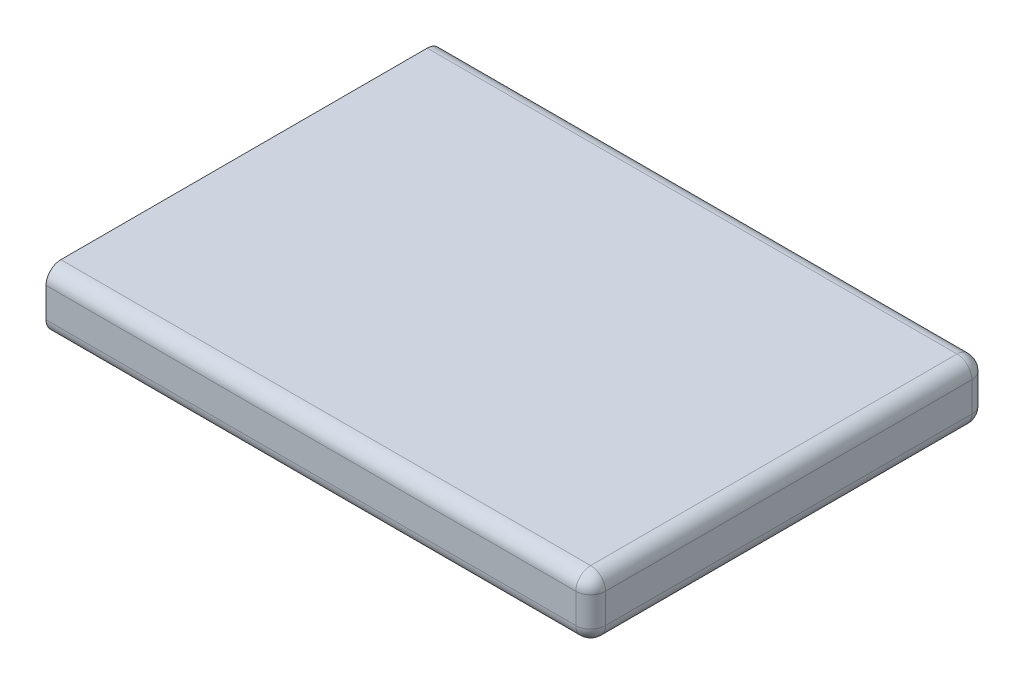
ISO-10303-21;
HEADER;
FILE_DESCRIPTION(('STEP AP214'),'2;1');
FILE_NAME('part.step','',(''),(''),'','','');
FILE_SCHEMA(('AUTOMOTIVE_DESIGN { 1 0 10303 214 1 1 1 1 }'));
ENDSEC;
DATA;
#1=APPLICATION_CONTEXT('core data for automotive mechanical design processes');
#2=APPLICATION_PROTOCOL_DEFINITION('international standard','automotive_design',2000,#1);
#3=PRODUCT_CONTEXT('',#1,'mechanical');
#4=PRODUCT('Part','Part','',(#3));
#5=PRODUCT_RELATED_PRODUCT_CATEGORY('part','',(#4));
#6=PRODUCT_DEFINITION_FORMATION('','',#4);
#7=PRODUCT_DEFINITION_CONTEXT('part definition',#1,'design');
#8=PRODUCT_DEFINITION('design','',#6,#7);
#9=PRODUCT_DEFINITION_SHAPE('','',#8);
#10=(LENGTH_UNIT() NAMED_UNIT(*) SI_UNIT(.MILLI.,.METRE.));
#11=(NAMED_UNIT(*) PLANE_ANGLE_UNIT() SI_UNIT($,.RADIAN.));
#12=(NAMED_UNIT(*) SI_UNIT($,.STERADIAN.) SOLID_ANGLE_UNIT());
#13=UNCERTAINTY_MEASURE_WITH_UNIT(LENGTH_MEASURE(1.E-05),#10,'distance_accuracy_value','');
#14=(GEOMETRIC_REPRESENTATION_CONTEXT(3) GLOBAL_UNCERTAINTY_ASSIGNED_CONTEXT((#13)) GLOBAL_UNIT_ASSIGNED_CONTEXT((#10,
#11,#12)) REPRESENTATION_CONTEXT('',''));
#15=CARTESIAN_POINT('',(0.,0.,0.));
#16=DIRECTION('',(0.,0.,1.));
#17=DIRECTION('',(1.,0.,0.));
#18=AXIS2_PLACEMENT_3D('',#15,#16,#17);
#19=CARTESIAN_POINT('',(33.894807191743,6.,-7.628255018401));
#20=DIRECTION('',(0.,-1.,0.));
#21=DIRECTION('',(0.,0.,-1.));
#22=AXIS2_PLACEMENT_3D('',#19,#20,#21);
#23=CYLINDRICAL_SURFACE('',#22,1.5);
#24=CARTESIAN_POINT('',(33.894807191743,4.5,-7.628255018401));
#25=DIRECTION('',(0.,-1.,0.));
#26=DIRECTION('',(0.,0.,1.));
#27=AXIS2_PLACEMENT_3D('',#24,#25,#26);
#28=CIRCLE('',#27,1.5);
#29=CARTESIAN_POINT('',(33.894807191743,4.5,-9.128255018401));
#30=VERTEX_POINT('',#29);
#31=CARTESIAN_POINT('',(35.394807191743,4.5,-7.628255018401));
#32=VERTEX_POINT('',#31);
#33=EDGE_CURVE('E26',#30,#32,#28,.T.);
#34=ORIENTED_EDGE('',*,*,#33,.T.);
#35=DIRECTION('',(0.,1.,0.));
#36=VECTOR('',#35,1.);
#37=CARTESIAN_POINT('',(35.394807191743,6.,-7.628255018401));
#38=LINE('',#37,#36);
#39=CARTESIAN_POINT('',(35.394807191743,1.5,-7.628255018401));
#40=VERTEX_POINT('',#39);
#41=EDGE_CURVE('E147',#40,#32,#38,.T.);
#42=ORIENTED_EDGE('',*,*,#41,.F.);
#43=CARTESIAN_POINT('',(33.894807191743,1.5,-7.628255018401));
#44=DIRECTION('',(0.,1.,0.));
#45=DIRECTION('',(0.,0.,-1.));
#46=AXIS2_PLACEMENT_3D('',#43,#44,#45);
#47=CIRCLE('',#46,1.5);
#48=CARTESIAN_POINT('',(33.894807191743,1.5,-9.128255018401));
#49=VERTEX_POINT('',#48);
#50=EDGE_CURVE('E11',#40,#49,#47,.T.);
#51=ORIENTED_EDGE('',*,*,#50,.T.);
#52=DIRECTION('',(0.,-1.,0.));
#53=VECTOR('',#52,1.);
#54=CARTESIAN_POINT('',(33.894807191743,6.,-9.128255018401));
#55=LINE('',#54,#53);
#56=EDGE_CURVE('E194',#30,#49,#55,.T.);
#57=ORIENTED_EDGE('',*,*,#56,.F.);
#58=EDGE_LOOP('',(#34,#42,#51,#57));
#59=FACE_BOUND('',#58,.T.);
#60=ADVANCED_FACE('F16',(#59),#23,.T.);
#61=CARTESIAN_POINT('',(33.894807191743,1.5,-7.628255018401));
#62=DIRECTION('',(0.,-1.,0.));
#63=DIRECTION('',(0.,0.,-1.));
#64=AXIS2_PLACEMENT_3D('',#61,#62,#63);
#65=SPHERICAL_SURFACE('',#64,1.5);
#66=CARTESIAN_POINT('',(33.894807191743,1.5,-7.628255018401));
#67=DIRECTION('',(0.,0.,-1.));
#68=DIRECTION('',(-1.,0.,0.));
#69=AXIS2_PLACEMENT_3D('',#66,#67,#68);
#70=CIRCLE('',#69,1.5);
#71=CARTESIAN_POINT('',(33.894807191743,0.,-7.628255018401));
#72=VERTEX_POINT('',#71);
#73=EDGE_CURVE('E198',#40,#72,#70,.T.);
#74=ORIENTED_EDGE('',*,*,#73,.T.);
#75=CARTESIAN_POINT('',(33.894807191743,1.5,-7.628255018401));
#76=DIRECTION('',(1.,0.,0.));
#77=DIRECTION('',(0.,0.,-1.));
#78=AXIS2_PLACEMENT_3D('',#75,#76,#77);
#79=CIRCLE('',#78,1.5);
#80=EDGE_CURVE('E201',#72,#49,#79,.T.);
#81=ORIENTED_EDGE('',*,*,#80,.T.);
#82=ORIENTED_EDGE('',*,*,#50,.F.);
#83=EDGE_LOOP('',(#74,#81,#82));
#84=FACE_BOUND('',#83,.T.);
#85=ADVANCED_FACE('F296',(#84),#65,.T.);
#86=CARTESIAN_POINT('',(33.894807191743,4.5,-7.628255018401));
#87=DIRECTION('',(0.,1.,0.));
#88=DIRECTION('',(0.,0.,1.));
#89=AXIS2_PLACEMENT_3D('',#86,#87,#88);
#90=SPHERICAL_SURFACE('',#89,1.5);
#91=CARTESIAN_POINT('',(33.894807191743,4.5,-7.628255018401));
#92=DIRECTION('',(1.,0.,0.));
#93=DIRECTION('',(0.,0.,-1.));
#94=AXIS2_PLACEMENT_3D('',#91,#92,#93);
#95=CIRCLE('',#94,1.5);
#96=CARTESIAN_POINT('',(33.894807191743,6.,-7.628255018401));
#97=VERTEX_POINT('',#96);
#98=EDGE_CURVE('E173',#30,#97,#95,.T.);
#99=ORIENTED_EDGE('',*,*,#98,.T.);
#100=CARTESIAN_POINT('',(33.894807191743,4.5,-7.628255018401));
#101=DIRECTION('',(0.,0.,-1.));
#102=DIRECTION('',(-1.,0.,0.));
#103=AXIS2_PLACEMENT_3D('',#100,#101,#102);
#104=CIRCLE('',#103,1.5);
#105=EDGE_CURVE('E221',#97,#32,#104,.T.);
#106=ORIENTED_EDGE('',*,*,#105,.T.);
#107=ORIENTED_EDGE('',*,*,#33,.F.);
#108=EDGE_LOOP('',(#99,#106,#107));
#109=FACE_BOUND('',#108,.T.);
#110=ADVANCED_FACE('F303',(#109),#90,.T.);
#111=CARTESIAN_POINT('',(33.894807191743,1.5,30.871744981599));
#112=DIRECTION('',(0.,0.,1.));
#113=DIRECTION('',(1.,0.,0.));
#114=AXIS2_PLACEMENT_3D('',#111,#112,#113);
#115=CYLINDRICAL_SURFACE('',#114,1.5);
#116=CARTESIAN_POINT('',(33.894807191743,1.5,29.371744981599));
#117=DIRECTION('',(0.,0.,-1.));
#118=DIRECTION('',(1.,0.,0.));
#119=AXIS2_PLACEMENT_3D('',#116,#117,#118);
#120=CIRCLE('',#119,1.5);
#121=CARTESIAN_POINT('',(35.394807191743,1.5,29.371744981599));
#122=VERTEX_POINT('',#121);
#123=CARTESIAN_POINT('',(33.894807191743,0.,29.371744981599));
#124=VERTEX_POINT('',#123);
#125=EDGE_CURVE('E39',#122,#124,#120,.T.);
#126=ORIENTED_EDGE('',*,*,#125,.T.);
#127=DIRECTION('',(0.,0.,1.));
#128=VECTOR('',#127,1.);
#129=CARTESIAN_POINT('',(33.894807191743,0.,30.871744981599));
#130=LINE('',#129,#128);
#131=EDGE_CURVE('E182',#72,#124,#130,.T.);
#132=ORIENTED_EDGE('',*,*,#131,.F.);
#133=ORIENTED_EDGE('',*,*,#73,.F.);
#134=DIRECTION('',(0.,0.,-1.));
#135=VECTOR('',#134,1.);
#136=CARTESIAN_POINT('',(35.394807191743,1.5,-9.128255018401));
#137=LINE('',#136,#135);
#138=EDGE_CURVE('E190',#122,#40,#137,.T.);
#139=ORIENTED_EDGE('',*,*,#138,.F.);
#140=EDGE_LOOP('',(#126,#132,#133,#139));
#141=FACE_BOUND('',#140,.T.);
#142=ADVANCED_FACE('F307',(#141),#115,.T.);
#143=CARTESIAN_POINT('',(-19.60519280825,1.5,-7.628255018401));
#144=DIRECTION('',(1.,0.,0.));
#145=DIRECTION('',(0.,0.,-1.));
#146=AXIS2_PLACEMENT_3D('',#143,#144,#145);
#147=CYLINDRICAL_SURFACE('',#146,1.5);
#148=CARTESIAN_POINT('',(-19.60519280825,1.5,-7.628255018401));
#149=DIRECTION('',(-1.,0.,0.));
#150=DIRECTION('',(0.,0.,-1.));
#151=AXIS2_PLACEMENT_3D('',#148,#149,#150);
#152=CIRCLE('',#151,1.5);
#153=CARTESIAN_POINT('',(-19.60519280825,1.5,-9.128255018401));
#154=VERTEX_POINT('',#153);
#155=CARTESIAN_POINT('',(-19.60519280825,0.,-7.628255018401));
#156=VERTEX_POINT('',#155);
#157=EDGE_CURVE('E202',#154,#156,#152,.T.);
#158=ORIENTED_EDGE('',*,*,#157,.F.);
#159=DIRECTION('',(-1.,0.,0.));
#160=VECTOR('',#159,1.);
#161=CARTESIAN_POINT('',(-19.60519280825,1.5,-9.128255018401));
#162=LINE('',#161,#160);
#163=EDGE_CURVE('E233',#49,#154,#162,.T.);
#164=ORIENTED_EDGE('',*,*,#163,.F.);
#165=ORIENTED_EDGE('',*,*,#80,.F.);
#166=DIRECTION('',(1.,0.,0.));
#167=VECTOR('',#166,1.);
#168=CARTESIAN_POINT('',(35.394807191743,0.,-7.628255018401));
#169=LINE('',#168,#167);
#170=EDGE_CURVE('E181',#156,#72,#169,.T.);
#171=ORIENTED_EDGE('',*,*,#170,.F.);
#172=EDGE_LOOP('',(#158,#164,#165,#171));
#173=FACE_BOUND('',#172,.T.);
#174=ADVANCED_FACE('F18',(#173),#147,.T.);
#175=CARTESIAN_POINT('',(0.,4.5,-7.628255018401));
#176=DIRECTION('',(-1.,0.,0.));
#177=DIRECTION('',(0.,0.,1.));
#178=AXIS2_PLACEMENT_3D('',#175,#176,#177);
#179=CYLINDRICAL_SURFACE('',#178,1.5);
#180=CARTESIAN_POINT('',(-19.60519280825,4.5,-7.628255018401));
#181=DIRECTION('',(-1.,0.,0.));
#182=DIRECTION('',(0.,0.,-1.));
#183=AXIS2_PLACEMENT_3D('',#180,#181,#182);
#184=CIRCLE('',#183,1.5);
#185=CARTESIAN_POINT('',(-19.60519280825,6.,-7.628255018401));
#186=VERTEX_POINT('',#185);
#187=CARTESIAN_POINT('',(-19.60519280825,4.5,-9.128255018401));
#188=VERTEX_POINT('',#187);
#189=EDGE_CURVE('E238',#186,#188,#184,.T.);
#190=ORIENTED_EDGE('',*,*,#189,.F.);
#191=DIRECTION('',(-1.,0.,0.));
#192=VECTOR('',#191,1.);
#193=CARTESIAN_POINT('',(0.,6.,-7.628255018401));
#194=LINE('',#193,#192);
#195=EDGE_CURVE('E256',#97,#186,#194,.T.);
#196=ORIENTED_EDGE('',*,*,#195,.F.);
#197=ORIENTED_EDGE('',*,*,#98,.F.);
#198=DIRECTION('',(1.,0.,0.));
#199=VECTOR('',#198,1.);
#200=CARTESIAN_POINT('',(-19.60519280825,4.5,-9.128255018401));
#201=LINE('',#200,#199);
#202=EDGE_CURVE('E228',#188,#30,#201,.T.);
#203=ORIENTED_EDGE('',*,*,#202,.F.);
#204=EDGE_LOOP('',(#190,#196,#197,#203));
#205=FACE_BOUND('',#204,.T.);
#206=ADVANCED_FACE('F276',(#205),#179,.T.);
#207=CARTESIAN_POINT('',(33.894807191743,4.5,0.));
#208=DIRECTION('',(0.,0.,-1.));
#209=DIRECTION('',(-1.,0.,0.));
#210=AXIS2_PLACEMENT_3D('',#207,#208,#209);
#211=CYLINDRICAL_SURFACE('',#210,1.5);
#212=CARTESIAN_POINT('',(33.894807191743,4.5,29.371744981599));
#213=DIRECTION('',(0.,0.,-1.));
#214=DIRECTION('',(1.,0.,0.));
#215=AXIS2_PLACEMENT_3D('',#212,#213,#214);
#216=CIRCLE('',#215,1.5);
#217=CARTESIAN_POINT('',(33.894807191743,6.,29.371744981599));
#218=VERTEX_POINT('',#217);
#219=CARTESIAN_POINT('',(35.394807191743,4.5,29.371744981599));
#220=VERTEX_POINT('',#219);
#221=EDGE_CURVE('E177',#218,#220,#216,.T.);
#222=ORIENTED_EDGE('',*,*,#221,.T.);
#223=DIRECTION('',(0.,0.,1.));
#224=VECTOR('',#223,1.);
#225=CARTESIAN_POINT('',(35.394807191743,4.5,30.871744981599));
#226=LINE('',#225,#224);
#227=EDGE_CURVE('E210',#32,#220,#226,.T.);
#228=ORIENTED_EDGE('',*,*,#227,.F.);
#229=ORIENTED_EDGE('',*,*,#105,.F.);
#230=DIRECTION('',(0.,0.,-1.));
#231=VECTOR('',#230,1.);
#232=CARTESIAN_POINT('',(33.894807191743,6.,0.));
#233=LINE('',#232,#231);
#234=EDGE_CURVE('E232',#218,#97,#233,.T.);
#235=ORIENTED_EDGE('',*,*,#234,.F.);
#236=EDGE_LOOP('',(#222,#228,#229,#235));
#237=FACE_BOUND('',#236,.T.);
#238=ADVANCED_FACE('F309',(#237),#211,.T.);
#239=CARTESIAN_POINT('',(33.894807191743,1.5,29.371744981599));
#240=DIRECTION('',(0.,0.,1.));
#241=DIRECTION('',(0.,-1.,0.));
#242=AXIS2_PLACEMENT_3D('',#239,#240,#241);
#243=SPHERICAL_SURFACE('',#242,1.5);
#244=CARTESIAN_POINT('',(33.894807191743,1.5,29.371744981599));
#245=DIRECTION('',(0.,-1.,0.));
#246=DIRECTION('',(0.,0.,-1.));
#247=AXIS2_PLACEMENT_3D('',#244,#245,#246);
#248=CIRCLE('',#247,1.5);
#249=CARTESIAN_POINT('',(33.894807191743,1.5,30.871744981599));
#250=VERTEX_POINT('',#249);
#251=EDGE_CURVE('E175',#122,#250,#248,.T.);
#252=ORIENTED_EDGE('',*,*,#251,.T.);
#253=CARTESIAN_POINT('',(33.894807191743,1.5,29.371744981599));
#254=DIRECTION('',(1.,0.,0.));
#255=DIRECTION('',(0.,0.,-1.));
#256=AXIS2_PLACEMENT_3D('',#253,#254,#255);
#257=CIRCLE('',#256,1.5);
#258=EDGE_CURVE('E188',#250,#124,#257,.T.);
#259=ORIENTED_EDGE('',*,*,#258,.T.);
#260=ORIENTED_EDGE('',*,*,#125,.F.);
#261=EDGE_LOOP('',(#252,#259,#260));
#262=FACE_BOUND('',#261,.T.);
#263=ADVANCED_FACE('F311',(#262),#243,.T.);
#264=CARTESIAN_POINT('',(33.894807191743,4.5,29.371744981599));
#265=DIRECTION('',(0.,0.,1.));
#266=DIRECTION('',(1.,0.,0.));
#267=AXIS2_PLACEMENT_3D('',#264,#265,#266);
#268=SPHERICAL_SURFACE('',#267,1.5);
#269=CARTESIAN_POINT('',(33.894807191743,4.5,29.371744981599));
#270=DIRECTION('',(1.,0.,0.));
#271=DIRECTION('',(0.,0.,-1.));
#272=AXIS2_PLACEMENT_3D('',#269,#270,#271);
#273=CIRCLE('',#272,1.5);
#274=CARTESIAN_POINT('',(33.894807191743,4.5,30.871744981599));
#275=VERTEX_POINT('',#274);
#276=EDGE_CURVE('E186',#218,#275,#273,.T.);
#277=ORIENTED_EDGE('',*,*,#276,.T.);
#278=CARTESIAN_POINT('',(33.894807191743,4.5,29.371744981599));
#279=DIRECTION('',(0.,1.,0.));
#280=DIRECTION('',(0.,0.,1.));
#281=AXIS2_PLACEMENT_3D('',#278,#279,#280);
#282=CIRCLE('',#281,1.5);
#283=EDGE_CURVE('E98',#275,#220,#282,.T.);
#284=ORIENTED_EDGE('',*,*,#283,.T.);
#285=ORIENTED_EDGE('',*,*,#221,.F.);
#286=EDGE_LOOP('',(#277,#284,#285));
#287=FACE_BOUND('',#286,.T.);
#288=ADVANCED_FACE('F317',(#287),#268,.T.);
#289=CARTESIAN_POINT('',(33.894807191743,6.,29.371744981599));
#290=DIRECTION('',(0.,-1.,0.));
#291=DIRECTION('',(0.,0.,-1.));
#292=AXIS2_PLACEMENT_3D('',#289,#290,#291);
#293=CYLINDRICAL_SURFACE('',#292,1.5);
#294=ORIENTED_EDGE('',*,*,#283,.F.);
#295=DIRECTION('',(0.,1.,0.));
#296=VECTOR('',#295,1.);
#297=CARTESIAN_POINT('',(33.894807191743,6.,30.871744981599));
#298=LINE('',#297,#296);
#299=EDGE_CURVE('E143',#250,#275,#298,.T.);
#300=ORIENTED_EDGE('',*,*,#299,.F.);
#301=ORIENTED_EDGE('',*,*,#251,.F.);
#302=DIRECTION('',(0.,-1.,0.));
#303=VECTOR('',#302,1.);
#304=CARTESIAN_POINT('',(35.394807191743,6.,29.371744981599));
#305=LINE('',#304,#303);
#306=EDGE_CURVE('E195',#220,#122,#305,.T.);
#307=ORIENTED_EDGE('',*,*,#306,.F.);
#308=EDGE_LOOP('',(#294,#300,#301,#307));
#309=FACE_BOUND('',#308,.T.);
#310=ADVANCED_FACE('F323',(#309),#293,.T.);
#311=CARTESIAN_POINT('',(-19.60519280825,1.5,29.371744981599));
#312=DIRECTION('',(-1.,0.,0.));
#313=DIRECTION('',(0.,0.,1.));
#314=AXIS2_PLACEMENT_3D('',#311,#312,#313);
#315=CYLINDRICAL_SURFACE('',#314,1.5);
#316=CARTESIAN_POINT('',(-19.60519280825,1.5,29.371744981599));
#317=DIRECTION('',(-1.,0.,0.));
#318=DIRECTION('',(0.,0.,-1.));
#319=AXIS2_PLACEMENT_3D('',#316,#317,#318);
#320=CIRCLE('',#319,1.5);
#321=CARTESIAN_POINT('',(-19.60519280825,0.,29.371744981599));
#322=VERTEX_POINT('',#321);
#323=CARTESIAN_POINT('',(-19.60519280825,1.5,30.871744981599));
#324=VERTEX_POINT('',#323);
#325=EDGE_CURVE('E162',#322,#324,#320,.T.);
#326=ORIENTED_EDGE('',*,*,#325,.F.);
#327=DIRECTION('',(-1.,0.,0.));
#328=VECTOR('',#327,1.);
#329=CARTESIAN_POINT('',(-19.60519280825,0.,29.371744981599));
#330=LINE('',#329,#328);
#331=EDGE_CURVE('E178',#124,#322,#330,.T.);
#332=ORIENTED_EDGE('',*,*,#331,.F.);
#333=ORIENTED_EDGE('',*,*,#258,.F.);
#334=DIRECTION('',(1.,0.,0.));
#335=VECTOR('',#334,1.);
#336=CARTESIAN_POINT('',(35.394807191743,1.5,30.871744981599));
#337=LINE('',#336,#335);
#338=EDGE_CURVE('E130',#324,#250,#337,.T.);
#339=ORIENTED_EDGE('',*,*,#338,.F.);
#340=EDGE_LOOP('',(#326,#332,#333,#339));
#341=FACE_BOUND('',#340,.T.);
#342=ADVANCED_FACE('F321',(#341),#315,.T.);
#343=CARTESIAN_POINT('',(0.,4.5,29.371744981599));
#344=DIRECTION('',(1.,0.,0.));
#345=DIRECTION('',(0.,0.,-1.));
#346=AXIS2_PLACEMENT_3D('',#343,#344,#345);
#347=CYLINDRICAL_SURFACE('',#346,1.5);
#348=CARTESIAN_POINT('',(-19.60519280825,4.5,29.371744981599));
#349=DIRECTION('',(-1.,0.,0.));
#350=DIRECTION('',(0.,0.,-1.));
#351=AXIS2_PLACEMENT_3D('',#348,#349,#350);
#352=CIRCLE('',#351,1.5);
#353=CARTESIAN_POINT('',(-19.60519280825,4.5,30.871744981599));
#354=VERTEX_POINT('',#353);
#355=CARTESIAN_POINT('',(-19.60519280825,6.,29.371744981599));
#356=VERTEX_POINT('',#355);
#357=EDGE_CURVE('E150',#354,#356,#352,.T.);
#358=ORIENTED_EDGE('',*,*,#357,.F.);
#359=DIRECTION('',(-1.,0.,0.));
#360=VECTOR('',#359,1.);
#361=CARTESIAN_POINT('',(-19.60519280825,4.5,30.871744981599));
#362=LINE('',#361,#360);
#363=EDGE_CURVE('E137',#275,#354,#362,.T.);
#364=ORIENTED_EDGE('',*,*,#363,.F.);
#365=ORIENTED_EDGE('',*,*,#276,.F.);
#366=DIRECTION('',(1.,0.,0.));
#367=VECTOR('',#366,1.);
#368=CARTESIAN_POINT('',(0.,6.,29.371744981599));
#369=LINE('',#368,#367);
#370=EDGE_CURVE('E153',#356,#218,#369,.T.);
#371=ORIENTED_EDGE('',*,*,#370,.F.);
#372=EDGE_LOOP('',(#358,#364,#365,#371));
#373=FACE_BOUND('',#372,.T.);
#374=ADVANCED_FACE('F151',(#373),#347,.T.);
#375=CARTESIAN_POINT('',(0.,0.,0.));
#376=DIRECTION('',(0.,-1.,0.));
#377=DIRECTION('',(0.,0.,-1.));
#378=AXIS2_PLACEMENT_3D('',#375,#376,#377);
#379=PLANE('',#378);
#380=ORIENTED_EDGE('',*,*,#131,.T.);
#381=ORIENTED_EDGE('',*,*,#331,.T.);
#382=DIRECTION('',(0.,0.,1.));
#383=VECTOR('',#382,1.);
#384=CARTESIAN_POINT('',(-19.60519280825,0.,30.871744981599));
#385=LINE('',#384,#383);
#386=EDGE_CURVE('E169',#156,#322,#385,.T.);
#387=ORIENTED_EDGE('',*,*,#386,.F.);
#388=ORIENTED_EDGE('',*,*,#170,.T.);
#389=EDGE_LOOP('',(#380,#381,#387,#388));
#390=FACE_BOUND('',#389,.T.);
#391=ADVANCED_FACE('F290',(#390),#379,.T.);
#392=CARTESIAN_POINT('',(0.,6.,0.));
#393=DIRECTION('',(0.,-1.,0.));
#394=DIRECTION('',(0.,0.,-1.));
#395=AXIS2_PLACEMENT_3D('',#392,#393,#394);
#396=PLANE('',#395);
#397=ORIENTED_EDGE('',*,*,#234,.T.);
#398=ORIENTED_EDGE('',*,*,#195,.T.);
#399=DIRECTION('',(0.,0.,1.));
#400=VECTOR('',#399,1.);
#401=CARTESIAN_POINT('',(-19.60519280825,6.,30.871744981599));
#402=LINE('',#401,#400);
#403=EDGE_CURVE('E158',#186,#356,#402,.T.);
#404=ORIENTED_EDGE('',*,*,#403,.T.);
#405=ORIENTED_EDGE('',*,*,#370,.T.);
#406=EDGE_LOOP('',(#397,#398,#404,#405));
#407=FACE_BOUND('',#406,.T.);
#408=ADVANCED_FACE('F280',(#407),#396,.F.);
#409=CARTESIAN_POINT('',(-19.60519280825,6.,-9.128255018401));
#410=DIRECTION('',(0.,0.,1.));
#411=DIRECTION('',(1.,0.,0.));
#412=AXIS2_PLACEMENT_3D('',#409,#410,#411);
#413=PLANE('',#412);
#414=ORIENTED_EDGE('',*,*,#56,.T.);
#415=ORIENTED_EDGE('',*,*,#163,.T.);
#416=DIRECTION('',(0.,-1.,0.));
#417=VECTOR('',#416,1.);
#418=CARTESIAN_POINT('',(-19.60519280825,6.,-9.128255018401));
#419=LINE('',#418,#417);
#420=EDGE_CURVE('E206',#188,#154,#419,.T.);
#421=ORIENTED_EDGE('',*,*,#420,.F.);
#422=ORIENTED_EDGE('',*,*,#202,.T.);
#423=EDGE_LOOP('',(#414,#415,#421,#422));
#424=FACE_BOUND('',#423,.T.);
#425=ADVANCED_FACE('F277',(#424),#413,.F.);
#426=CARTESIAN_POINT('',(35.394807191743,6.,30.871744981599));
#427=DIRECTION('',(-1.,0.,0.));
#428=DIRECTION('',(0.,0.,1.));
#429=AXIS2_PLACEMENT_3D('',#426,#427,#428);
#430=PLANE('',#429);
#431=ORIENTED_EDGE('',*,*,#41,.T.);
#432=ORIENTED_EDGE('',*,*,#227,.T.);
#433=ORIENTED_EDGE('',*,*,#306,.T.);
#434=ORIENTED_EDGE('',*,*,#138,.T.);
#435=EDGE_LOOP('',(#431,#432,#433,#434));
#436=FACE_BOUND('',#435,.T.);
#437=ADVANCED_FACE('F279',(#436),#430,.F.);
#438=CARTESIAN_POINT('',(-19.60519280825,6.,30.871744981599));
#439=DIRECTION('',(0.,0.,-1.));
#440=DIRECTION('',(0.,-1.,0.));
#441=AXIS2_PLACEMENT_3D('',#438,#439,#440);
#442=PLANE('',#441);
#443=DIRECTION('',(0.,-1.,0.));
#444=VECTOR('',#443,1.);
#445=CARTESIAN_POINT('',(-19.60519280825,6.,30.871744981599));
#446=LINE('',#445,#444);
#447=EDGE_CURVE('E141',#354,#324,#446,.T.);
#448=ORIENTED_EDGE('',*,*,#447,.T.);
#449=ORIENTED_EDGE('',*,*,#338,.T.);
#450=ORIENTED_EDGE('',*,*,#299,.T.);
#451=ORIENTED_EDGE('',*,*,#363,.T.);
#452=EDGE_LOOP('',(#448,#449,#450,#451));
#453=FACE_BOUND('',#452,.T.);
#454=ADVANCED_FACE('F139',(#453),#442,.F.);
#455=CARTESIAN_POINT('',(-19.60519280825,6.,30.871744981599));
#456=DIRECTION('',(1.,0.,0.));
#457=DIRECTION('',(0.,1.,0.));
#458=AXIS2_PLACEMENT_3D('',#455,#456,#457);
#459=PLANE('',#458);
#460=ORIENTED_EDGE('',*,*,#386,.T.);
#461=ORIENTED_EDGE('',*,*,#325,.T.);
#462=ORIENTED_EDGE('',*,*,#447,.F.);
#463=ORIENTED_EDGE('',*,*,#357,.T.);
#464=ORIENTED_EDGE('',*,*,#403,.F.);
#465=ORIENTED_EDGE('',*,*,#189,.T.);
#466=ORIENTED_EDGE('',*,*,#420,.T.);
#467=ORIENTED_EDGE('',*,*,#157,.T.);
#468=EDGE_LOOP('',(#460,#461,#462,#463,#464,#465,#466,#467));
#469=FACE_BOUND('',#468,.T.);
#470=ADVANCED_FACE('F161',(#469),#459,.F.);
#471=CLOSED_SHELL('',(#60,#85,#110,#142,#174,#206,#238,#263,#288,#310,#342,#374,#391,#408,#425,
#437,#454,#470));
#472=MANIFOLD_SOLID_BREP('B1',#471);
#473=ADVANCED_BREP_SHAPE_REPRESENTATION('',(#18,#472),#14);
#474=SHAPE_DEFINITION_REPRESENTATION(#9,#473);
ENDSEC;
END-ISO-10303-21;
